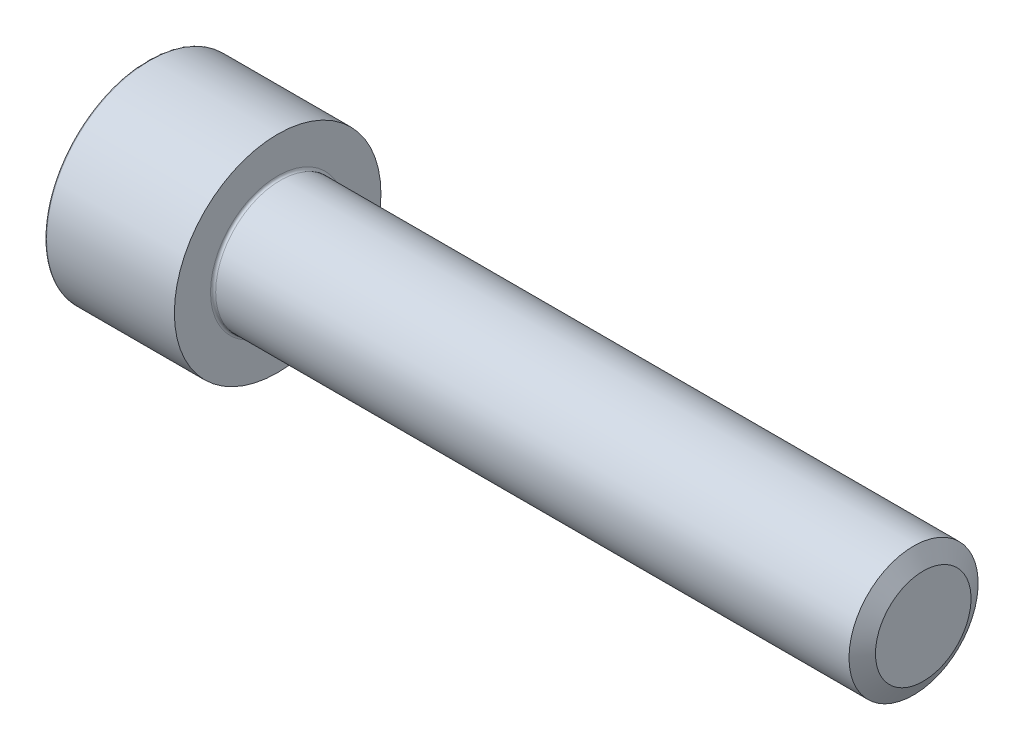
ISO-10303-21;
HEADER;
FILE_DESCRIPTION(('STEP AP214'),'2;1');
FILE_NAME('part.step','',(''),(''),'','','');
FILE_SCHEMA(('AUTOMOTIVE_DESIGN { 1 0 10303 214 1 1 1 1 }'));
ENDSEC;
DATA;
#1=APPLICATION_CONTEXT('core data for automotive mechanical design processes');
#2=APPLICATION_PROTOCOL_DEFINITION('international standard','automotive_design',2000,#1);
#3=PRODUCT_CONTEXT('',#1,'mechanical');
#4=PRODUCT('Part','Part','',(#3));
#5=PRODUCT_RELATED_PRODUCT_CATEGORY('part','',(#4));
#6=PRODUCT_DEFINITION_FORMATION('','',#4);
#7=PRODUCT_DEFINITION_CONTEXT('part definition',#1,'design');
#8=PRODUCT_DEFINITION('design','',#6,#7);
#9=PRODUCT_DEFINITION_SHAPE('','',#8);
#10=(LENGTH_UNIT() NAMED_UNIT(*) SI_UNIT(.MILLI.,.METRE.));
#11=(NAMED_UNIT(*) PLANE_ANGLE_UNIT() SI_UNIT($,.RADIAN.));
#12=(NAMED_UNIT(*) SI_UNIT($,.STERADIAN.) SOLID_ANGLE_UNIT());
#13=UNCERTAINTY_MEASURE_WITH_UNIT(LENGTH_MEASURE(1.E-05),#10,'distance_accuracy_value','');
#14=(GEOMETRIC_REPRESENTATION_CONTEXT(3) GLOBAL_UNCERTAINTY_ASSIGNED_CONTEXT((#13)) GLOBAL_UNIT_ASSIGNED_CONTEXT((#10,
#11,#12)) REPRESENTATION_CONTEXT('',''));
#15=CARTESIAN_POINT('',(0.,0.,0.));
#16=DIRECTION('',(0.,0.,1.));
#17=DIRECTION('',(1.,0.,0.));
#18=AXIS2_PLACEMENT_3D('',#15,#16,#17);
#19=CARTESIAN_POINT('',(0.,0.,0.));
#20=DIRECTION('',(-1.,0.,0.));
#21=DIRECTION('',(0.,0.,1.));
#22=AXIS2_PLACEMENT_3D('',#19,#20,#21);
#23=CYLINDRICAL_SURFACE('',#22,5.);
#24=CARTESIAN_POINT('',(10.2,0.,0.));
#25=DIRECTION('',(-1.,0.,0.));
#26=DIRECTION('',(0.,0.,1.));
#27=AXIS2_PLACEMENT_3D('',#24,#25,#26);
#28=CIRCLE('',#27,5.);
#29=CARTESIAN_POINT('',(10.2,0.,5.));
#30=VERTEX_POINT('',#29);
#31=EDGE_CURVE('E142',#30,#30,#28,.T.);
#32=ORIENTED_EDGE('',*,*,#31,.F.);
#33=EDGE_LOOP('',(#32));
#34=FACE_BOUND('',#33,.T.);
#35=CARTESIAN_POINT('',(59.2500220003227,0.,0.));
#36=DIRECTION('',(-1.,0.,0.));
#37=DIRECTION('',(0.,0.,1.));
#38=AXIS2_PLACEMENT_3D('',#35,#36,#37);
#39=CIRCLE('',#38,5.);
#40=CARTESIAN_POINT('',(59.2500220003227,0.,5.));
#41=VERTEX_POINT('',#40);
#42=EDGE_CURVE('E279',#41,#41,#39,.T.);
#43=ORIENTED_EDGE('',*,*,#42,.T.);
#44=EDGE_LOOP('',(#43));
#45=FACE_BOUND('',#44,.T.);
#46=ADVANCED_FACE('F39',(#34,#45),#23,.T.);
#47=CARTESIAN_POINT('',(0.,0.,0.));
#48=DIRECTION('',(1.,0.,0.));
#49=DIRECTION('',(0.,0.,-1.));
#50=AXIS2_PLACEMENT_3D('',#47,#48,#49);
#51=PLANE('',#50);
#52=CARTESIAN_POINT('',(0.,0.,0.));
#53=DIRECTION('',(1.,0.,0.));
#54=DIRECTION('',(0.,0.,-1.));
#55=AXIS2_PLACEMENT_3D('',#52,#53,#54);
#56=CIRCLE('',#55,7.9);
#57=CARTESIAN_POINT('',(0.,0.,-7.9));
#58=VERTEX_POINT('',#57);
#59=EDGE_CURVE('E47',#58,#58,#56,.F.);
#60=ORIENTED_EDGE('',*,*,#59,.T.);
#61=EDGE_LOOP('',(#60));
#62=FACE_BOUND('',#61,.T.);
#63=DIRECTION('',(0.,0.866025403784438,-0.5));
#64=VECTOR('',#63,1.);
#65=CARTESIAN_POINT('',(0.,0.,4.575));
#66=LINE('',#65,#64);
#67=CARTESIAN_POINT('',(0.,0.,4.575));
#68=VERTEX_POINT('',#67);
#69=CARTESIAN_POINT('',(0.,3.96206622231381,2.2875));
#70=VERTEX_POINT('',#69);
#71=EDGE_CURVE('E128',#68,#70,#66,.T.);
#72=ORIENTED_EDGE('',*,*,#71,.F.);
#73=DIRECTION('',(0.,0.866025403784439,0.5));
#74=VECTOR('',#73,1.);
#75=CARTESIAN_POINT('',(0.,-3.96206622231381,2.2875));
#76=LINE('',#75,#74);
#77=CARTESIAN_POINT('',(0.,-3.96206622231381,2.2875));
#78=VERTEX_POINT('',#77);
#79=EDGE_CURVE('E54',#78,#68,#76,.T.);
#80=ORIENTED_EDGE('',*,*,#79,.F.);
#81=DIRECTION('',(0.,0.,1.));
#82=VECTOR('',#81,1.);
#83=CARTESIAN_POINT('',(0.,-3.96206622231381,-2.2875));
#84=LINE('',#83,#82);
#85=CARTESIAN_POINT('',(0.,-3.96206622231381,-2.2875));
#86=VERTEX_POINT('',#85);
#87=EDGE_CURVE('E138',#86,#78,#84,.T.);
#88=ORIENTED_EDGE('',*,*,#87,.F.);
#89=DIRECTION('',(0.,-0.866025403784439,0.5));
#90=VECTOR('',#89,1.);
#91=CARTESIAN_POINT('',(0.,0.,-4.575));
#92=LINE('',#91,#90);
#93=CARTESIAN_POINT('',(0.,0.,-4.575));
#94=VERTEX_POINT('',#93);
#95=EDGE_CURVE('E136',#94,#86,#92,.T.);
#96=ORIENTED_EDGE('',*,*,#95,.F.);
#97=DIRECTION('',(0.,-0.866025403784439,-0.5));
#98=VECTOR('',#97,1.);
#99=CARTESIAN_POINT('',(0.,3.96206622231381,-2.2875));
#100=LINE('',#99,#98);
#101=CARTESIAN_POINT('',(0.,3.96206622231381,-2.2875));
#102=VERTEX_POINT('',#101);
#103=EDGE_CURVE('E102',#102,#94,#100,.T.);
#104=ORIENTED_EDGE('',*,*,#103,.F.);
#105=DIRECTION('',(0.,0.,-1.));
#106=VECTOR('',#105,1.);
#107=CARTESIAN_POINT('',(0.,3.96206622231381,2.2875));
#108=LINE('',#107,#106);
#109=EDGE_CURVE('E132',#70,#102,#108,.T.);
#110=ORIENTED_EDGE('',*,*,#109,.F.);
#111=EDGE_LOOP('',(#72,#80,#88,#96,#104,#110));
#112=FACE_BOUND('',#111,.T.);
#113=ADVANCED_FACE('F159',(#62,#112),#51,.F.);
#114=CARTESIAN_POINT('',(0.,0.,0.));
#115=DIRECTION('',(-1.,0.,0.));
#116=DIRECTION('',(0.,0.,1.));
#117=AXIS2_PLACEMENT_3D('',#114,#115,#116);
#118=CYLINDRICAL_SURFACE('',#117,8.);
#119=CARTESIAN_POINT('',(0.1,0.,0.));
#120=DIRECTION('',(1.,0.,0.));
#121=DIRECTION('',(0.,0.,-1.));
#122=AXIS2_PLACEMENT_3D('',#119,#120,#121);
#123=CIRCLE('',#122,8.);
#124=CARTESIAN_POINT('',(0.1,0.,-8.));
#125=VERTEX_POINT('',#124);
#126=EDGE_CURVE('E11',#125,#125,#123,.T.);
#127=ORIENTED_EDGE('',*,*,#126,.T.);
#128=EDGE_LOOP('',(#127));
#129=FACE_BOUND('',#128,.T.);
#130=CARTESIAN_POINT('',(10.,0.,0.));
#131=DIRECTION('',(-1.,0.,0.));
#132=DIRECTION('',(0.,0.,1.));
#133=AXIS2_PLACEMENT_3D('',#130,#131,#132);
#134=CIRCLE('',#133,8.);
#135=CARTESIAN_POINT('',(10.,0.,8.));
#136=VERTEX_POINT('',#135);
#137=EDGE_CURVE('E153',#136,#136,#134,.T.);
#138=ORIENTED_EDGE('',*,*,#137,.T.);
#139=EDGE_LOOP('',(#138));
#140=FACE_BOUND('',#139,.T.);
#141=ADVANCED_FACE('F178',(#129,#140),#118,.T.);
#142=CARTESIAN_POINT('',(10.,8.,0.));
#143=DIRECTION('',(-1.,0.,0.));
#144=DIRECTION('',(0.,0.,1.));
#145=AXIS2_PLACEMENT_3D('',#142,#143,#144);
#146=PLANE('',#145);
#147=ORIENTED_EDGE('',*,*,#137,.F.);
#148=EDGE_LOOP('',(#147));
#149=FACE_BOUND('',#148,.T.);
#150=CARTESIAN_POINT('',(10.,0.,0.));
#151=DIRECTION('',(-1.,0.,0.));
#152=DIRECTION('',(0.,0.,1.));
#153=AXIS2_PLACEMENT_3D('',#150,#151,#152);
#154=CIRCLE('',#153,5.2);
#155=CARTESIAN_POINT('',(10.,0.,5.2));
#156=VERTEX_POINT('',#155);
#157=EDGE_CURVE('E150',#156,#156,#154,.T.);
#158=ORIENTED_EDGE('',*,*,#157,.T.);
#159=EDGE_LOOP('',(#158));
#160=FACE_BOUND('',#159,.T.);
#161=ADVANCED_FACE('F187',(#149,#160),#146,.F.);
#162=CARTESIAN_POINT('',(10.2,0.,0.));
#163=DIRECTION('',(-1.,0.,0.));
#164=DIRECTION('',(0.,0.,1.));
#165=AXIS2_PLACEMENT_3D('',#162,#163,#164);
#166=TOROIDAL_SURFACE('',#165,5.2,0.2);
#167=ORIENTED_EDGE('',*,*,#157,.F.);
#168=EDGE_LOOP('',(#167));
#169=FACE_BOUND('',#168,.T.);
#170=ORIENTED_EDGE('',*,*,#31,.T.);
#171=EDGE_LOOP('',(#170));
#172=FACE_BOUND('',#171,.T.);
#173=ADVANCED_FACE('F183',(#169,#172),#166,.F.);
#174=CARTESIAN_POINT('',(5.,-3.96206622231381,2.2875));
#175=DIRECTION('',(0.,-0.5,0.866025403784439));
#176=DIRECTION('',(0.,-0.866025403784439,-0.5));
#177=AXIS2_PLACEMENT_3D('',#174,#175,#176);
#178=PLANE('',#177);
#179=ORIENTED_EDGE('',*,*,#79,.T.);
#180=DIRECTION('',(-1.,0.,0.));
#181=VECTOR('',#180,1.);
#182=CARTESIAN_POINT('',(5.,0.,4.575));
#183=LINE('',#182,#181);
#184=CARTESIAN_POINT('',(5.,0.,4.575));
#185=VERTEX_POINT('',#184);
#186=EDGE_CURVE('E84',#185,#68,#183,.T.);
#187=ORIENTED_EDGE('',*,*,#186,.F.);
#188=DIRECTION('',(0.,0.866025403784439,0.5));
#189=VECTOR('',#188,1.);
#190=CARTESIAN_POINT('',(5.,-3.96206622231381,2.2875));
#191=LINE('',#190,#189);
#192=CARTESIAN_POINT('',(5.,-3.96206622231381,2.2875));
#193=VERTEX_POINT('',#192);
#194=EDGE_CURVE('E140',#193,#185,#191,.T.);
#195=ORIENTED_EDGE('',*,*,#194,.F.);
#196=DIRECTION('',(-1.,0.,0.));
#197=VECTOR('',#196,1.);
#198=CARTESIAN_POINT('',(5.,-3.96206622231381,2.2875));
#199=LINE('',#198,#197);
#200=EDGE_CURVE('E62',#193,#78,#199,.T.);
#201=ORIENTED_EDGE('',*,*,#200,.T.);
#202=EDGE_LOOP('',(#179,#187,#195,#201));
#203=FACE_BOUND('',#202,.T.);
#204=ADVANCED_FACE('F186',(#203),#178,.F.);
#205=CARTESIAN_POINT('',(5.,-3.96206622231381,-2.2875));
#206=DIRECTION('',(0.,-1.,0.));
#207=DIRECTION('',(0.,0.,-1.));
#208=AXIS2_PLACEMENT_3D('',#205,#206,#207);
#209=PLANE('',#208);
#210=ORIENTED_EDGE('',*,*,#87,.T.);
#211=ORIENTED_EDGE('',*,*,#200,.F.);
#212=DIRECTION('',(0.,0.,1.));
#213=VECTOR('',#212,1.);
#214=CARTESIAN_POINT('',(5.,-3.96206622231381,-2.2875));
#215=LINE('',#214,#213);
#216=CARTESIAN_POINT('',(5.,-3.96206622231381,-2.2875));
#217=VERTEX_POINT('',#216);
#218=EDGE_CURVE('E114',#217,#193,#215,.T.);
#219=ORIENTED_EDGE('',*,*,#218,.F.);
#220=DIRECTION('',(-1.,0.,0.));
#221=VECTOR('',#220,1.);
#222=CARTESIAN_POINT('',(5.,-3.96206622231381,-2.2875));
#223=LINE('',#222,#221);
#224=EDGE_CURVE('E106',#217,#86,#223,.T.);
#225=ORIENTED_EDGE('',*,*,#224,.T.);
#226=EDGE_LOOP('',(#210,#211,#219,#225));
#227=FACE_BOUND('',#226,.T.);
#228=ADVANCED_FACE('F217',(#227),#209,.F.);
#229=CARTESIAN_POINT('',(5.,0.,-4.575));
#230=DIRECTION('',(0.,-0.5,-0.866025403784439));
#231=DIRECTION('',(0.,0.866025403784439,-0.5));
#232=AXIS2_PLACEMENT_3D('',#229,#230,#231);
#233=PLANE('',#232);
#234=ORIENTED_EDGE('',*,*,#95,.T.);
#235=ORIENTED_EDGE('',*,*,#224,.F.);
#236=DIRECTION('',(0.,-0.866025403784439,0.5));
#237=VECTOR('',#236,1.);
#238=CARTESIAN_POINT('',(5.,0.,-4.575));
#239=LINE('',#238,#237);
#240=CARTESIAN_POINT('',(5.,0.,-4.575));
#241=VERTEX_POINT('',#240);
#242=EDGE_CURVE('E110',#241,#217,#239,.T.);
#243=ORIENTED_EDGE('',*,*,#242,.F.);
#244=DIRECTION('',(-1.,0.,0.));
#245=VECTOR('',#244,1.);
#246=CARTESIAN_POINT('',(5.,0.,-4.575));
#247=LINE('',#246,#245);
#248=EDGE_CURVE('E95',#241,#94,#247,.T.);
#249=ORIENTED_EDGE('',*,*,#248,.T.);
#250=EDGE_LOOP('',(#234,#235,#243,#249));
#251=FACE_BOUND('',#250,.T.);
#252=ADVANCED_FACE('F111',(#251),#233,.F.);
#253=CARTESIAN_POINT('',(5.,3.96206622231381,-2.2875));
#254=DIRECTION('',(0.,0.5,-0.866025403784439));
#255=DIRECTION('',(0.,0.866025403784439,0.5));
#256=AXIS2_PLACEMENT_3D('',#253,#254,#255);
#257=PLANE('',#256);
#258=ORIENTED_EDGE('',*,*,#103,.T.);
#259=ORIENTED_EDGE('',*,*,#248,.F.);
#260=DIRECTION('',(0.,-0.866025403784439,-0.5));
#261=VECTOR('',#260,1.);
#262=CARTESIAN_POINT('',(5.,3.96206622231381,-2.2875));
#263=LINE('',#262,#261);
#264=CARTESIAN_POINT('',(5.,3.96206622231381,-2.2875));
#265=VERTEX_POINT('',#264);
#266=EDGE_CURVE('E99',#265,#241,#263,.T.);
#267=ORIENTED_EDGE('',*,*,#266,.F.);
#268=DIRECTION('',(-1.,0.,0.));
#269=VECTOR('',#268,1.);
#270=CARTESIAN_POINT('',(5.,3.96206622231381,-2.2875));
#271=LINE('',#270,#269);
#272=EDGE_CURVE('E107',#265,#102,#271,.T.);
#273=ORIENTED_EDGE('',*,*,#272,.T.);
#274=EDGE_LOOP('',(#258,#259,#267,#273));
#275=FACE_BOUND('',#274,.T.);
#276=ADVANCED_FACE('F97',(#275),#257,.F.);
#277=CARTESIAN_POINT('',(5.,3.96206622231381,2.2875));
#278=DIRECTION('',(0.,1.,0.));
#279=DIRECTION('',(0.,0.,1.));
#280=AXIS2_PLACEMENT_3D('',#277,#278,#279);
#281=PLANE('',#280);
#282=ORIENTED_EDGE('',*,*,#109,.T.);
#283=ORIENTED_EDGE('',*,*,#272,.F.);
#284=DIRECTION('',(0.,0.,-1.));
#285=VECTOR('',#284,1.);
#286=CARTESIAN_POINT('',(5.,3.96206622231381,2.2875));
#287=LINE('',#286,#285);
#288=CARTESIAN_POINT('',(5.,3.96206622231381,2.2875));
#289=VERTEX_POINT('',#288);
#290=EDGE_CURVE('E120',#289,#265,#287,.T.);
#291=ORIENTED_EDGE('',*,*,#290,.F.);
#292=DIRECTION('',(-1.,0.,0.));
#293=VECTOR('',#292,1.);
#294=CARTESIAN_POINT('',(5.,3.96206622231381,2.2875));
#295=LINE('',#294,#293);
#296=EDGE_CURVE('E145',#289,#70,#295,.T.);
#297=ORIENTED_EDGE('',*,*,#296,.T.);
#298=EDGE_LOOP('',(#282,#283,#291,#297));
#299=FACE_BOUND('',#298,.T.);
#300=ADVANCED_FACE('F235',(#299),#281,.F.);
#301=CARTESIAN_POINT('',(5.,0.,4.575));
#302=DIRECTION('',(0.,0.5,0.866025403784439));
#303=DIRECTION('',(0.,-0.866025403784439,0.5));
#304=AXIS2_PLACEMENT_3D('',#301,#302,#303);
#305=PLANE('',#304);
#306=ORIENTED_EDGE('',*,*,#71,.T.);
#307=ORIENTED_EDGE('',*,*,#296,.F.);
#308=DIRECTION('',(0.,0.866025403784438,-0.5));
#309=VECTOR('',#308,1.);
#310=CARTESIAN_POINT('',(5.,0.,4.575));
#311=LINE('',#310,#309);
#312=EDGE_CURVE('E122',#185,#289,#311,.T.);
#313=ORIENTED_EDGE('',*,*,#312,.F.);
#314=ORIENTED_EDGE('',*,*,#186,.T.);
#315=EDGE_LOOP('',(#306,#307,#313,#314));
#316=FACE_BOUND('',#315,.T.);
#317=ADVANCED_FACE('F242',(#316),#305,.F.);
#318=CARTESIAN_POINT('',(5.,-3.96206622231381,2.2875));
#319=DIRECTION('',(1.,0.,0.));
#320=DIRECTION('',(0.,0.,-1.));
#321=AXIS2_PLACEMENT_3D('',#318,#319,#320);
#322=PLANE('',#321);
#323=ORIENTED_EDGE('',*,*,#194,.T.);
#324=ORIENTED_EDGE('',*,*,#312,.T.);
#325=ORIENTED_EDGE('',*,*,#290,.T.);
#326=ORIENTED_EDGE('',*,*,#266,.T.);
#327=ORIENTED_EDGE('',*,*,#242,.T.);
#328=ORIENTED_EDGE('',*,*,#218,.T.);
#329=EDGE_LOOP('',(#323,#324,#325,#326,#327,#328));
#330=FACE_BOUND('',#329,.T.);
#331=ADVANCED_FACE('F117',(#330),#322,.F.);
#332=CARTESIAN_POINT('',(59.2500220003227,0.,0.));
#333=DIRECTION('',(-1.,0.,0.));
#334=DIRECTION('',(0.,0.,1.));
#335=AXIS2_PLACEMENT_3D('',#332,#333,#334);
#336=CONICAL_SURFACE('',#335,5.,1.04719755119658);
#337=CARTESIAN_POINT('',(60.,0.,0.));
#338=DIRECTION('',(-1.,0.,0.));
#339=DIRECTION('',(0.,0.,1.));
#340=AXIS2_PLACEMENT_3D('',#337,#338,#339);
#341=CIRCLE('',#340,3.701);
#342=CARTESIAN_POINT('',(60.,0.,3.701));
#343=VERTEX_POINT('',#342);
#344=EDGE_CURVE('E129',#343,#343,#341,.T.);
#345=ORIENTED_EDGE('',*,*,#344,.T.);
#346=EDGE_LOOP('',(#345));
#347=FACE_BOUND('',#346,.T.);
#348=ORIENTED_EDGE('',*,*,#42,.F.);
#349=EDGE_LOOP('',(#348));
#350=FACE_BOUND('',#349,.T.);
#351=ADVANCED_FACE('F168',(#347,#350),#336,.T.);
#352=CARTESIAN_POINT('',(60.,5.,0.));
#353=DIRECTION('',(-1.,0.,0.));
#354=DIRECTION('',(0.,0.,1.));
#355=AXIS2_PLACEMENT_3D('',#352,#353,#354);
#356=PLANE('',#355);
#357=ORIENTED_EDGE('',*,*,#344,.F.);
#358=EDGE_LOOP('',(#357));
#359=FACE_BOUND('',#358,.T.);
#360=ADVANCED_FACE('F163',(#359),#356,.F.);
#361=CARTESIAN_POINT('',(0.1,0.,0.));
#362=DIRECTION('',(1.,0.,0.));
#363=DIRECTION('',(0.,0.,-1.));
#364=AXIS2_PLACEMENT_3D('',#361,#362,#363);
#365=TOROIDAL_SURFACE('',#364,7.9,0.1);
#366=ORIENTED_EDGE('',*,*,#126,.F.);
#367=EDGE_LOOP('',(#366));
#368=FACE_BOUND('',#367,.T.);
#369=ORIENTED_EDGE('',*,*,#59,.F.);
#370=EDGE_LOOP('',(#369));
#371=FACE_BOUND('',#370,.T.);
#372=ADVANCED_FACE('F41',(#368,#371),#365,.T.);
#373=CLOSED_SHELL('',(#46,#113,#141,#161,#173,#204,#228,#252,#276,#300,#317,#331,#351,#360,#372));
#374=MANIFOLD_SOLID_BREP('B2',#373);
#375=ADVANCED_BREP_SHAPE_REPRESENTATION('',(#18,#374),#14);
#376=SHAPE_DEFINITION_REPRESENTATION(#9,#375);
ENDSEC;
END-ISO-10303-21;
